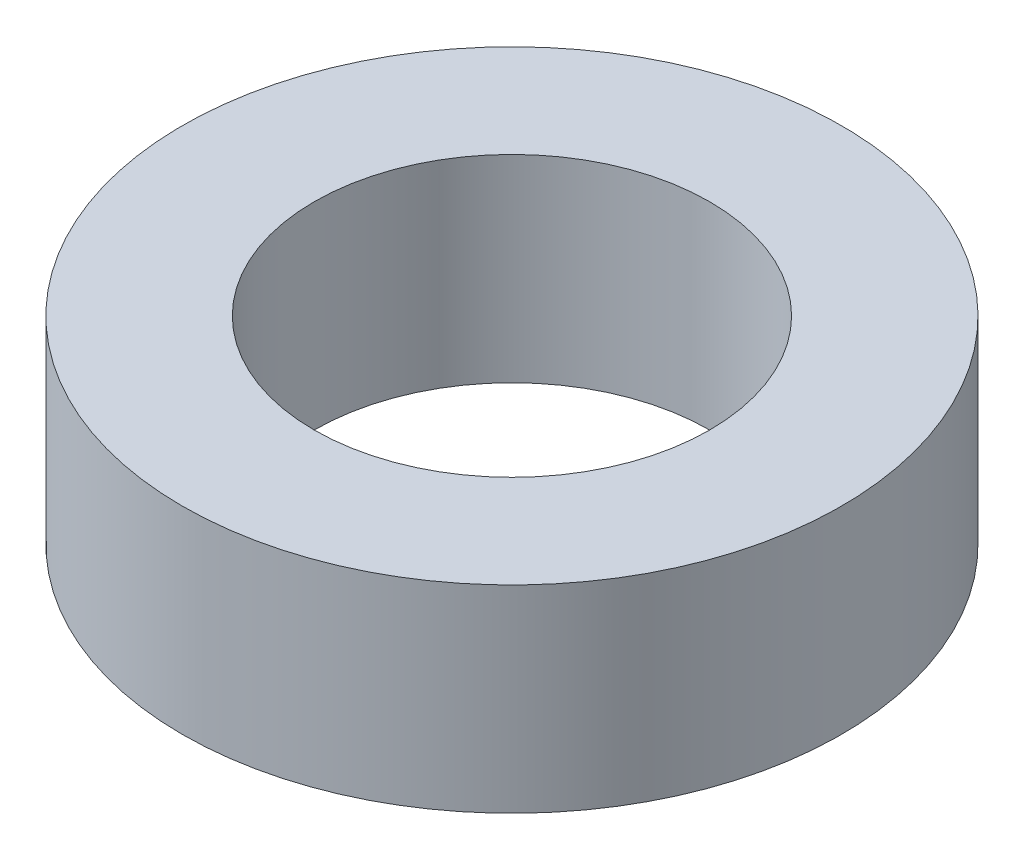
ISO-10303-21;
HEADER;
FILE_DESCRIPTION(('STEP AP214'),'2;1');
FILE_NAME('part.step','',(''),(''),'','','');
FILE_SCHEMA(('AUTOMOTIVE_DESIGN { 1 0 10303 214 1 1 1 1 }'));
ENDSEC;
DATA;
#1=APPLICATION_CONTEXT('core data for automotive mechanical design processes');
#2=APPLICATION_PROTOCOL_DEFINITION('international standard','automotive_design',2000,#1);
#3=PRODUCT_CONTEXT('',#1,'mechanical');
#4=PRODUCT('Part','Part','',(#3));
#5=PRODUCT_RELATED_PRODUCT_CATEGORY('part','',(#4));
#6=PRODUCT_DEFINITION_FORMATION('','',#4);
#7=PRODUCT_DEFINITION_CONTEXT('part definition',#1,'design');
#8=PRODUCT_DEFINITION('design','',#6,#7);
#9=PRODUCT_DEFINITION_SHAPE('','',#8);
#10=(LENGTH_UNIT() NAMED_UNIT(*) SI_UNIT(.MILLI.,.METRE.));
#11=(NAMED_UNIT(*) PLANE_ANGLE_UNIT() SI_UNIT($,.RADIAN.));
#12=(NAMED_UNIT(*) SI_UNIT($,.STERADIAN.) SOLID_ANGLE_UNIT());
#13=UNCERTAINTY_MEASURE_WITH_UNIT(LENGTH_MEASURE(1.E-05),#10,'distance_accuracy_value','');
#14=(GEOMETRIC_REPRESENTATION_CONTEXT(3) GLOBAL_UNCERTAINTY_ASSIGNED_CONTEXT((#13)) GLOBAL_UNIT_ASSIGNED_CONTEXT((#10,
#11,#12)) REPRESENTATION_CONTEXT('',''));
#15=CARTESIAN_POINT('',(0.,0.,0.));
#16=DIRECTION('',(0.,0.,1.));
#17=DIRECTION('',(1.,0.,0.));
#18=AXIS2_PLACEMENT_3D('',#15,#16,#17);
#19=CARTESIAN_POINT('',(0.,3.,0.));
#20=DIRECTION('',(0.,1.,0.));
#21=DIRECTION('',(0.,0.,1.));
#22=AXIS2_PLACEMENT_3D('',#19,#20,#21);
#23=PLANE('',#22);
#24=CARTESIAN_POINT('',(0.,3.,0.));
#25=DIRECTION('',(0.,1.,0.));
#26=DIRECTION('',(0.,0.,1.));
#27=AXIS2_PLACEMENT_3D('',#24,#25,#26);
#28=CIRCLE('',#27,5.);
#29=CARTESIAN_POINT('',(0.,3.,5.));
#30=VERTEX_POINT('',#29);
#31=EDGE_CURVE('E10',#30,#30,#28,.T.);
#32=ORIENTED_EDGE('',*,*,#31,.T.);
#33=EDGE_LOOP('',(#32));
#34=FACE_BOUND('',#33,.T.);
#35=CARTESIAN_POINT('',(0.,3.,0.));
#36=DIRECTION('',(0.,1.,0.));
#37=DIRECTION('',(0.,0.,1.));
#38=AXIS2_PLACEMENT_3D('',#35,#36,#37);
#39=CIRCLE('',#38,3.);
#40=CARTESIAN_POINT('',(0.,3.,3.));
#41=VERTEX_POINT('',#40);
#42=EDGE_CURVE('E42',#41,#41,#39,.T.);
#43=ORIENTED_EDGE('',*,*,#42,.F.);
#44=EDGE_LOOP('',(#43));
#45=FACE_BOUND('',#44,.T.);
#46=ADVANCED_FACE('F31',(#34,#45),#23,.T.);
#47=CARTESIAN_POINT('',(0.,0.,0.));
#48=DIRECTION('',(0.,1.,0.));
#49=DIRECTION('',(0.,0.,1.));
#50=AXIS2_PLACEMENT_3D('',#47,#48,#49);
#51=PLANE('',#50);
#52=CARTESIAN_POINT('',(0.,0.,0.));
#53=DIRECTION('',(0.,1.,0.));
#54=DIRECTION('',(0.,0.,1.));
#55=AXIS2_PLACEMENT_3D('',#52,#53,#54);
#56=CIRCLE('',#55,5.);
#57=CARTESIAN_POINT('',(0.,0.,5.));
#58=VERTEX_POINT('',#57);
#59=EDGE_CURVE('E35',#58,#58,#56,.T.);
#60=ORIENTED_EDGE('',*,*,#59,.F.);
#61=EDGE_LOOP('',(#60));
#62=FACE_BOUND('',#61,.T.);
#63=CARTESIAN_POINT('',(0.,0.,0.));
#64=DIRECTION('',(0.,1.,0.));
#65=DIRECTION('',(0.,0.,1.));
#66=AXIS2_PLACEMENT_3D('',#63,#64,#65);
#67=CIRCLE('',#66,3.);
#68=CARTESIAN_POINT('',(0.,0.,3.));
#69=VERTEX_POINT('',#68);
#70=EDGE_CURVE('E44',#69,#69,#67,.T.);
#71=ORIENTED_EDGE('',*,*,#70,.T.);
#72=EDGE_LOOP('',(#71));
#73=FACE_BOUND('',#72,.T.);
#74=ADVANCED_FACE('F54',(#62,#73),#51,.F.);
#75=CARTESIAN_POINT('',(0.,3.,0.));
#76=DIRECTION('',(0.,-1.,0.));
#77=DIRECTION('',(0.,0.,-1.));
#78=AXIS2_PLACEMENT_3D('',#75,#76,#77);
#79=CYLINDRICAL_SURFACE('',#78,5.);
#80=ORIENTED_EDGE('',*,*,#31,.F.);
#81=EDGE_LOOP('',(#80));
#82=FACE_BOUND('',#81,.T.);
#83=ORIENTED_EDGE('',*,*,#59,.T.);
#84=EDGE_LOOP('',(#83));
#85=FACE_BOUND('',#84,.T.);
#86=ADVANCED_FACE('F33',(#82,#85),#79,.T.);
#87=CARTESIAN_POINT('',(0.,3.,0.));
#88=DIRECTION('',(0.,-1.,0.));
#89=DIRECTION('',(0.,0.,-1.));
#90=AXIS2_PLACEMENT_3D('',#87,#88,#89);
#91=CYLINDRICAL_SURFACE('',#90,3.);
#92=ORIENTED_EDGE('',*,*,#42,.T.);
#93=EDGE_LOOP('',(#92));
#94=FACE_BOUND('',#93,.T.);
#95=ORIENTED_EDGE('',*,*,#70,.F.);
#96=EDGE_LOOP('',(#95));
#97=FACE_BOUND('',#96,.T.);
#98=ADVANCED_FACE('F50',(#94,#97),#91,.F.);
#99=CLOSED_SHELL('',(#46,#74,#86,#98));
#100=MANIFOLD_SOLID_BREP('B2',#99);
#101=ADVANCED_BREP_SHAPE_REPRESENTATION('',(#18,#100),#14);
#102=SHAPE_DEFINITION_REPRESENTATION(#9,#101);
ENDSEC;
END-ISO-10303-21;
